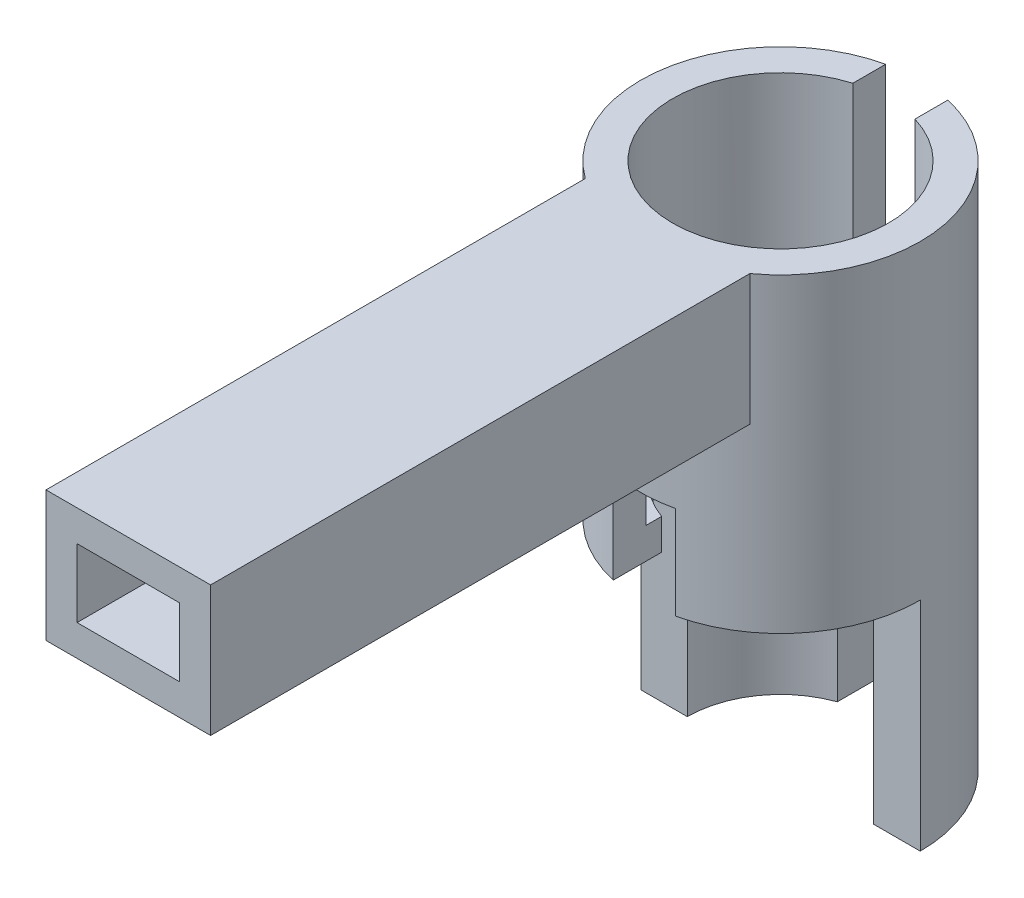
ISO-10303-21;
HEADER;
FILE_DESCRIPTION(('STEP AP214'),'2;1');
FILE_NAME('part.step','',(''),(''),'','','');
FILE_SCHEMA(('AUTOMOTIVE_DESIGN { 1 0 10303 214 1 1 1 1 }'));
ENDSEC;
DATA;
#1=APPLICATION_CONTEXT('core data for automotive mechanical design processes');
#2=APPLICATION_PROTOCOL_DEFINITION('international standard','automotive_design',2000,#1);
#3=PRODUCT_CONTEXT('',#1,'mechanical');
#4=PRODUCT('Part','Part','',(#3));
#5=PRODUCT_RELATED_PRODUCT_CATEGORY('part','',(#4));
#6=PRODUCT_DEFINITION_FORMATION('','',#4);
#7=PRODUCT_DEFINITION_CONTEXT('part definition',#1,'design');
#8=PRODUCT_DEFINITION('design','',#6,#7);
#9=PRODUCT_DEFINITION_SHAPE('','',#8);
#10=(LENGTH_UNIT() NAMED_UNIT(*) SI_UNIT(.MILLI.,.METRE.));
#11=(NAMED_UNIT(*) PLANE_ANGLE_UNIT() SI_UNIT($,.RADIAN.));
#12=(NAMED_UNIT(*) SI_UNIT($,.STERADIAN.) SOLID_ANGLE_UNIT());
#13=UNCERTAINTY_MEASURE_WITH_UNIT(LENGTH_MEASURE(1.E-05),#10,'distance_accuracy_value','');
#14=(GEOMETRIC_REPRESENTATION_CONTEXT(3) GLOBAL_UNCERTAINTY_ASSIGNED_CONTEXT((#13)) GLOBAL_UNIT_ASSIGNED_CONTEXT((#10,
#11,#12)) REPRESENTATION_CONTEXT('',''));
#15=CARTESIAN_POINT('',(0.,0.,0.));
#16=DIRECTION('',(0.,0.,1.));
#17=DIRECTION('',(1.,0.,0.));
#18=AXIS2_PLACEMENT_3D('',#15,#16,#17);
#19=CARTESIAN_POINT('',(0.,17.,0.));
#20=DIRECTION('',(0.,-1.,0.));
#21=DIRECTION('',(0.,0.,-1.));
#22=AXIS2_PLACEMENT_3D('',#19,#20,#21);
#23=CYLINDRICAL_SURFACE('',#22,4.5);
#24=DIRECTION('',(0.,-1.,0.));
#25=VECTOR('',#24,1.);
#26=CARTESIAN_POINT('',(-1.,17.,-4.38748219369606));
#27=LINE('',#26,#25);
#28=CARTESIAN_POINT('',(-1.,0.,-4.38748219369606));
#29=VERTEX_POINT('',#28);
#30=CARTESIAN_POINT('',(-1.,17.,-4.38748219369606));
#31=VERTEX_POINT('',#30);
#32=EDGE_CURVE('E312',#29,#31,#27,.F.);
#33=ORIENTED_EDGE('',*,*,#32,.F.);
#34=CARTESIAN_POINT('',(0.,0.,0.));
#35=DIRECTION('',(0.,1.,0.));
#36=DIRECTION('',(0.,0.,1.));
#37=AXIS2_PLACEMENT_3D('',#34,#35,#36);
#38=CIRCLE('',#37,4.5);
#39=CARTESIAN_POINT('',(-4.5,0.,0.));
#40=VERTEX_POINT('',#39);
#41=EDGE_CURVE('E264',#29,#40,#38,.T.);
#42=ORIENTED_EDGE('',*,*,#41,.T.);
#43=DIRECTION('',(0.,-1.,0.));
#44=VECTOR('',#43,1.);
#45=CARTESIAN_POINT('',(-4.5,17.,0.));
#46=LINE('',#45,#44);
#47=CARTESIAN_POINT('',(-4.5,7.,0.));
#48=VERTEX_POINT('',#47);
#49=EDGE_CURVE('E333',#48,#40,#46,.T.);
#50=ORIENTED_EDGE('',*,*,#49,.F.);
#51=CARTESIAN_POINT('',(0.,7.,0.));
#52=DIRECTION('',(0.,-1.,0.));
#53=DIRECTION('',(0.,0.,-1.));
#54=AXIS2_PLACEMENT_3D('',#51,#52,#53);
#55=CIRCLE('',#54,4.5);
#56=CARTESIAN_POINT('',(-1.,7.,4.38748219369606));
#57=VERTEX_POINT('',#56);
#58=EDGE_CURVE('E324',#57,#48,#55,.T.);
#59=ORIENTED_EDGE('',*,*,#58,.F.);
#60=DIRECTION('',(0.,-1.,0.));
#61=VECTOR('',#60,1.);
#62=CARTESIAN_POINT('',(-1.,17.,4.38748219369606));
#63=LINE('',#62,#61);
#64=CARTESIAN_POINT('',(-1.,10.,4.38748219369606));
#65=VERTEX_POINT('',#64);
#66=EDGE_CURVE('E347',#65,#57,#63,.T.);
#67=ORIENTED_EDGE('',*,*,#66,.F.);
#68=CARTESIAN_POINT('',(0.,10.,0.));
#69=DIRECTION('',(0.,1.,0.));
#70=DIRECTION('',(0.,0.,1.));
#71=AXIS2_PLACEMENT_3D('',#68,#69,#70);
#72=CIRCLE('',#71,4.5);
#73=CARTESIAN_POINT('',(1.,10.,4.38748219369606));
#74=VERTEX_POINT('',#73);
#75=EDGE_CURVE('E357',#65,#74,#72,.T.);
#76=ORIENTED_EDGE('',*,*,#75,.T.);
#77=DIRECTION('',(0.,-1.,0.));
#78=VECTOR('',#77,1.);
#79=CARTESIAN_POINT('',(1.,17.,4.38748219369606));
#80=LINE('',#79,#78);
#81=CARTESIAN_POINT('',(1.,7.,4.38748219369606));
#82=VERTEX_POINT('',#81);
#83=EDGE_CURVE('E355',#82,#74,#80,.F.);
#84=ORIENTED_EDGE('',*,*,#83,.F.);
#85=CARTESIAN_POINT('',(4.5,7.,0.));
#86=VERTEX_POINT('',#85);
#87=EDGE_CURVE('E328',#86,#82,#55,.T.);
#88=ORIENTED_EDGE('',*,*,#87,.F.);
#89=DIRECTION('',(0.,-1.,0.));
#90=VECTOR('',#89,1.);
#91=CARTESIAN_POINT('',(4.5,17.,0.));
#92=LINE('',#91,#90);
#93=CARTESIAN_POINT('',(4.5,0.,0.));
#94=VERTEX_POINT('',#93);
#95=EDGE_CURVE('E331',#94,#86,#92,.F.);
#96=ORIENTED_EDGE('',*,*,#95,.F.);
#97=CARTESIAN_POINT('',(1.,0.,-4.38748219369606));
#98=VERTEX_POINT('',#97);
#99=EDGE_CURVE('E273',#94,#98,#38,.T.);
#100=ORIENTED_EDGE('',*,*,#99,.T.);
#101=DIRECTION('',(0.,-1.,0.));
#102=VECTOR('',#101,1.);
#103=CARTESIAN_POINT('',(1.,17.,-4.38748219369606));
#104=LINE('',#103,#102);
#105=CARTESIAN_POINT('',(1.,17.,-4.38748219369606));
#106=VERTEX_POINT('',#105);
#107=EDGE_CURVE('E307',#106,#98,#104,.T.);
#108=ORIENTED_EDGE('',*,*,#107,.F.);
#109=CARTESIAN_POINT('',(0.,17.,0.));
#110=DIRECTION('',(0.,1.,0.));
#111=DIRECTION('',(0.,0.,1.));
#112=AXIS2_PLACEMENT_3D('',#109,#110,#111);
#113=CIRCLE('',#112,4.5);
#114=CARTESIAN_POINT('',(2.65,17.,3.63696301878367));
#115=VERTEX_POINT('',#114);
#116=EDGE_CURVE('E268',#115,#106,#113,.T.);
#117=ORIENTED_EDGE('',*,*,#116,.F.);
#118=DIRECTION('',(0.,-1.,0.));
#119=VECTOR('',#118,1.);
#120=CARTESIAN_POINT('',(2.65,17.,3.63696301878367));
#121=LINE('',#120,#119);
#122=CARTESIAN_POINT('',(2.65,12.8,3.63696301878367));
#123=VERTEX_POINT('',#122);
#124=EDGE_CURVE('E249',#123,#115,#121,.F.);
#125=ORIENTED_EDGE('',*,*,#124,.F.);
#126=CARTESIAN_POINT('',(0.,12.8,0.));
#127=DIRECTION('',(0.,1.,0.));
#128=DIRECTION('',(0.,0.,1.));
#129=AXIS2_PLACEMENT_3D('',#126,#127,#128);
#130=CIRCLE('',#129,4.5);
#131=CARTESIAN_POINT('',(-2.65,12.8,3.63696301878367));
#132=VERTEX_POINT('',#131);
#133=EDGE_CURVE('E243',#132,#123,#130,.T.);
#134=ORIENTED_EDGE('',*,*,#133,.F.);
#135=DIRECTION('',(0.,-1.,0.));
#136=VECTOR('',#135,1.);
#137=CARTESIAN_POINT('',(-2.65,17.,3.63696301878367));
#138=LINE('',#137,#136);
#139=CARTESIAN_POINT('',(-2.65,17.,3.63696301878367));
#140=VERTEX_POINT('',#139);
#141=EDGE_CURVE('E246',#140,#132,#138,.T.);
#142=ORIENTED_EDGE('',*,*,#141,.F.);
#143=EDGE_CURVE('E272',#31,#140,#113,.T.);
#144=ORIENTED_EDGE('',*,*,#143,.F.);
#145=EDGE_LOOP('',(#33,#42,#50,#59,#67,#76,#84,#88,#96,#100,#108,#117,#125,#134,#142,#144));
#146=FACE_BOUND('',#145,.T.);
#147=ADVANCED_FACE('F35',(#146),#23,.T.);
#148=CARTESIAN_POINT('',(0.,0.,0.));
#149=DIRECTION('',(0.,1.,0.));
#150=DIRECTION('',(0.,0.,1.));
#151=AXIS2_PLACEMENT_3D('',#148,#149,#150);
#152=PLANE('',#151);
#153=DIRECTION('',(0.,0.,-1.));
#154=VECTOR('',#153,1.);
#155=CARTESIAN_POINT('',(-1.,0.,0.));
#156=LINE('',#155,#154);
#157=CARTESIAN_POINT('',(-1.,0.,-2.82842712474619));
#158=VERTEX_POINT('',#157);
#159=EDGE_CURVE('E305',#158,#29,#156,.T.);
#160=ORIENTED_EDGE('',*,*,#159,.F.);
#161=CARTESIAN_POINT('',(0.,0.,0.));
#162=DIRECTION('',(0.,1.,0.));
#163=DIRECTION('',(0.,0.,1.));
#164=AXIS2_PLACEMENT_3D('',#161,#162,#163);
#165=CIRCLE('',#164,3.);
#166=CARTESIAN_POINT('',(-3.,0.,0.));
#167=VERTEX_POINT('',#166);
#168=EDGE_CURVE('E257',#158,#167,#165,.T.);
#169=ORIENTED_EDGE('',*,*,#168,.T.);
#170=DIRECTION('',(-1.,0.,0.));
#171=VECTOR('',#170,1.);
#172=CARTESIAN_POINT('',(7.42344171639214,0.,0.));
#173=LINE('',#172,#171);
#174=EDGE_CURVE('E314',#167,#40,#173,.T.);
#175=ORIENTED_EDGE('',*,*,#174,.T.);
#176=ORIENTED_EDGE('',*,*,#41,.F.);
#177=EDGE_LOOP('',(#160,#169,#175,#176));
#178=FACE_BOUND('',#177,.T.);
#179=ADVANCED_FACE('F447',(#178),#152,.F.);
#180=DIRECTION('',(0.,0.,1.));
#181=VECTOR('',#180,1.);
#182=CARTESIAN_POINT('',(1.,0.,0.));
#183=LINE('',#182,#181);
#184=CARTESIAN_POINT('',(1.,0.,-2.82842712474619));
#185=VERTEX_POINT('',#184);
#186=EDGE_CURVE('E399',#98,#185,#183,.T.);
#187=ORIENTED_EDGE('',*,*,#186,.F.);
#188=ORIENTED_EDGE('',*,*,#99,.F.);
#189=CARTESIAN_POINT('',(3.,0.,0.));
#190=VERTEX_POINT('',#189);
#191=EDGE_CURVE('E319',#94,#190,#173,.T.);
#192=ORIENTED_EDGE('',*,*,#191,.T.);
#193=EDGE_CURVE('E253',#190,#185,#165,.T.);
#194=ORIENTED_EDGE('',*,*,#193,.T.);
#195=EDGE_LOOP('',(#187,#188,#192,#194));
#196=FACE_BOUND('',#195,.T.);
#197=ADVANCED_FACE('F473',(#196),#152,.F.);
#198=CARTESIAN_POINT('',(0.,0.,0.));
#199=DIRECTION('',(0.,1.,0.));
#200=DIRECTION('',(0.,0.,1.));
#201=AXIS2_PLACEMENT_3D('',#198,#199,#200);
#202=CYLINDRICAL_SURFACE('',#201,3.);
#203=DIRECTION('',(0.,1.,0.));
#204=VECTOR('',#203,1.);
#205=CARTESIAN_POINT('',(-1.,0.,-2.82842712474619));
#206=LINE('',#205,#204);
#207=CARTESIAN_POINT('',(-1.,8.,-2.82842712474619));
#208=VERTEX_POINT('',#207);
#209=EDGE_CURVE('E302',#208,#158,#206,.F.);
#210=ORIENTED_EDGE('',*,*,#209,.F.);
#211=CARTESIAN_POINT('',(0.,8.,0.));
#212=DIRECTION('',(0.,1.,0.));
#213=DIRECTION('',(0.,0.,1.));
#214=AXIS2_PLACEMENT_3D('',#211,#212,#213);
#215=CIRCLE('',#214,3.);
#216=CARTESIAN_POINT('',(-1.,8.,2.82842712474619));
#217=VERTEX_POINT('',#216);
#218=EDGE_CURVE('E252',#208,#217,#215,.T.);
#219=ORIENTED_EDGE('',*,*,#218,.T.);
#220=DIRECTION('',(0.,1.,0.));
#221=VECTOR('',#220,1.);
#222=CARTESIAN_POINT('',(-1.,0.,2.82842712474619));
#223=LINE('',#222,#221);
#224=CARTESIAN_POINT('',(-1.,7.,2.82842712474619));
#225=VERTEX_POINT('',#224);
#226=EDGE_CURVE('E271',#225,#217,#223,.T.);
#227=ORIENTED_EDGE('',*,*,#226,.F.);
#228=CARTESIAN_POINT('',(0.,7.,0.));
#229=DIRECTION('',(0.,-1.,0.));
#230=DIRECTION('',(0.,0.,-1.));
#231=AXIS2_PLACEMENT_3D('',#228,#229,#230);
#232=CIRCLE('',#231,3.);
#233=CARTESIAN_POINT('',(-3.,7.,0.));
#234=VERTEX_POINT('',#233);
#235=EDGE_CURVE('E322',#234,#225,#232,.F.);
#236=ORIENTED_EDGE('',*,*,#235,.F.);
#237=DIRECTION('',(0.,1.,0.));
#238=VECTOR('',#237,1.);
#239=CARTESIAN_POINT('',(-3.,0.,0.));
#240=LINE('',#239,#238);
#241=EDGE_CURVE('E289',#167,#234,#240,.T.);
#242=ORIENTED_EDGE('',*,*,#241,.F.);
#243=ORIENTED_EDGE('',*,*,#168,.F.);
#244=EDGE_LOOP('',(#210,#219,#227,#236,#242,#243));
#245=FACE_BOUND('',#244,.T.);
#246=ADVANCED_FACE('F442',(#245),#202,.F.);
#247=DIRECTION('',(0.,1.,0.));
#248=VECTOR('',#247,1.);
#249=CARTESIAN_POINT('',(1.,0.,-2.82842712474619));
#250=LINE('',#249,#248);
#251=CARTESIAN_POINT('',(1.,8.,-2.82842712474619));
#252=VERTEX_POINT('',#251);
#253=EDGE_CURVE('E400',#185,#252,#250,.T.);
#254=ORIENTED_EDGE('',*,*,#253,.F.);
#255=ORIENTED_EDGE('',*,*,#193,.F.);
#256=DIRECTION('',(0.,1.,0.));
#257=VECTOR('',#256,1.);
#258=CARTESIAN_POINT('',(3.,0.,0.));
#259=LINE('',#258,#257);
#260=CARTESIAN_POINT('',(3.,7.,0.));
#261=VERTEX_POINT('',#260);
#262=EDGE_CURVE('E287',#261,#190,#259,.F.);
#263=ORIENTED_EDGE('',*,*,#262,.F.);
#264=CARTESIAN_POINT('',(1.,7.,2.82842712474619));
#265=VERTEX_POINT('',#264);
#266=EDGE_CURVE('E325',#265,#261,#232,.F.);
#267=ORIENTED_EDGE('',*,*,#266,.F.);
#268=DIRECTION('',(0.,1.,0.));
#269=VECTOR('',#268,1.);
#270=CARTESIAN_POINT('',(1.,0.,2.82842712474619));
#271=LINE('',#270,#269);
#272=CARTESIAN_POINT('',(1.,8.,2.82842712474619));
#273=VERTEX_POINT('',#272);
#274=EDGE_CURVE('E278',#273,#265,#271,.F.);
#275=ORIENTED_EDGE('',*,*,#274,.F.);
#276=EDGE_CURVE('E258',#273,#252,#215,.T.);
#277=ORIENTED_EDGE('',*,*,#276,.T.);
#278=EDGE_LOOP('',(#254,#255,#263,#267,#275,#277));
#279=FACE_BOUND('',#278,.T.);
#280=ADVANCED_FACE('F415',(#279),#202,.F.);
#281=CARTESIAN_POINT('',(0.,8.,0.));
#282=DIRECTION('',(0.,1.,0.));
#283=DIRECTION('',(0.,0.,1.));
#284=AXIS2_PLACEMENT_3D('',#281,#282,#283);
#285=CYLINDRICAL_SURFACE('',#284,3.475);
#286=DIRECTION('',(0.,1.,0.));
#287=VECTOR('',#286,1.);
#288=CARTESIAN_POINT('',(-1.,8.,-3.32800615985007));
#289=LINE('',#288,#287);
#290=CARTESIAN_POINT('',(-1.,17.,-3.32800615985007));
#291=VERTEX_POINT('',#290);
#292=CARTESIAN_POINT('',(-1.,8.,-3.32800615985007));
#293=VERTEX_POINT('',#292);
#294=EDGE_CURVE('E298',#291,#293,#289,.F.);
#295=ORIENTED_EDGE('',*,*,#294,.F.);
#296=CARTESIAN_POINT('',(0.,17.,0.));
#297=DIRECTION('',(0.,1.,0.));
#298=DIRECTION('',(0.,0.,1.));
#299=AXIS2_PLACEMENT_3D('',#296,#297,#298);
#300=CIRCLE('',#299,3.475);
#301=CARTESIAN_POINT('',(1.,17.,-3.32800615985007));
#302=VERTEX_POINT('',#301);
#303=EDGE_CURVE('E256',#291,#302,#300,.T.);
#304=ORIENTED_EDGE('',*,*,#303,.T.);
#305=DIRECTION('',(0.,1.,0.));
#306=VECTOR('',#305,1.);
#307=CARTESIAN_POINT('',(1.,8.,-3.32800615985007));
#308=LINE('',#307,#306);
#309=CARTESIAN_POINT('',(1.,8.,-3.32800615985007));
#310=VERTEX_POINT('',#309);
#311=EDGE_CURVE('E57',#310,#302,#308,.T.);
#312=ORIENTED_EDGE('',*,*,#311,.F.);
#313=CARTESIAN_POINT('',(0.,8.,0.));
#314=DIRECTION('',(0.,1.,0.));
#315=DIRECTION('',(0.,0.,1.));
#316=AXIS2_PLACEMENT_3D('',#313,#314,#315);
#317=CIRCLE('',#316,3.475);
#318=CARTESIAN_POINT('',(1.,8.,3.32800615985007));
#319=VERTEX_POINT('',#318);
#320=EDGE_CURVE('E261',#319,#310,#317,.T.);
#321=ORIENTED_EDGE('',*,*,#320,.F.);
#322=DIRECTION('',(0.,1.,0.));
#323=VECTOR('',#322,1.);
#324=CARTESIAN_POINT('',(1.,8.,3.32800615985007));
#325=LINE('',#324,#323);
#326=CARTESIAN_POINT('',(1.,10.,3.32800615985007));
#327=VERTEX_POINT('',#326);
#328=EDGE_CURVE('E353',#327,#319,#325,.F.);
#329=ORIENTED_EDGE('',*,*,#328,.F.);
#330=CARTESIAN_POINT('',(0.,10.,0.));
#331=DIRECTION('',(0.,1.,0.));
#332=DIRECTION('',(0.,0.,1.));
#333=AXIS2_PLACEMENT_3D('',#330,#331,#332);
#334=CIRCLE('',#333,3.475);
#335=CARTESIAN_POINT('',(-1.,10.,3.32800615985007));
#336=VERTEX_POINT('',#335);
#337=EDGE_CURVE('E281',#327,#336,#334,.F.);
#338=ORIENTED_EDGE('',*,*,#337,.T.);
#339=DIRECTION('',(0.,1.,0.));
#340=VECTOR('',#339,1.);
#341=CARTESIAN_POINT('',(-1.,8.,3.32800615985007));
#342=LINE('',#341,#340);
#343=CARTESIAN_POINT('',(-1.,8.,3.32800615985007));
#344=VERTEX_POINT('',#343);
#345=EDGE_CURVE('E345',#344,#336,#342,.T.);
#346=ORIENTED_EDGE('',*,*,#345,.F.);
#347=EDGE_CURVE('E265',#293,#344,#317,.T.);
#348=ORIENTED_EDGE('',*,*,#347,.F.);
#349=EDGE_LOOP('',(#295,#304,#312,#321,#329,#338,#346,#348));
#350=FACE_BOUND('',#349,.T.);
#351=CARTESIAN_POINT('',(0.,16.,0.));
#352=DIRECTION('',(0.,1.,0.));
#353=DIRECTION('',(0.,0.,1.));
#354=AXIS2_PLACEMENT_3D('',#351,#352,#353);
#355=CIRCLE('',#354,3.475);
#356=CARTESIAN_POINT('',(-1.65,16.,3.05828791973549));
#357=VERTEX_POINT('',#356);
#358=CARTESIAN_POINT('',(1.65,16.,3.05828791973549));
#359=VERTEX_POINT('',#358);
#360=EDGE_CURVE('E192',#357,#359,#355,.T.);
#361=ORIENTED_EDGE('',*,*,#360,.F.);
#362=DIRECTION('',(0.,1.,0.));
#363=VECTOR('',#362,1.);
#364=CARTESIAN_POINT('',(-1.65,10.,3.05828791973549));
#365=LINE('',#364,#363);
#366=CARTESIAN_POINT('',(-1.65,13.8,3.05828791973549));
#367=VERTEX_POINT('',#366);
#368=EDGE_CURVE('E195',#367,#357,#365,.T.);
#369=ORIENTED_EDGE('',*,*,#368,.F.);
#370=CARTESIAN_POINT('',(0.,13.8,0.));
#371=DIRECTION('',(0.,-1.,0.));
#372=DIRECTION('',(0.,0.,-1.));
#373=AXIS2_PLACEMENT_3D('',#370,#371,#372);
#374=CIRCLE('',#373,3.475);
#375=CARTESIAN_POINT('',(1.65,13.8,3.05828791973549));
#376=VERTEX_POINT('',#375);
#377=EDGE_CURVE('E208',#376,#367,#374,.T.);
#378=ORIENTED_EDGE('',*,*,#377,.F.);
#379=DIRECTION('',(0.,1.,0.));
#380=VECTOR('',#379,1.);
#381=CARTESIAN_POINT('',(1.65,10.,3.05828791973549));
#382=LINE('',#381,#380);
#383=EDGE_CURVE('E49',#359,#376,#382,.F.);
#384=ORIENTED_EDGE('',*,*,#383,.F.);
#385=EDGE_LOOP('',(#361,#369,#378,#384));
#386=FACE_BOUND('',#385,.T.);
#387=ADVANCED_FACE('F194',(#350,#386),#285,.F.);
#388=CARTESIAN_POINT('',(0.,8.,0.));
#389=DIRECTION('',(0.,1.,0.));
#390=DIRECTION('',(0.,0.,1.));
#391=AXIS2_PLACEMENT_3D('',#388,#389,#390);
#392=PLANE('',#391);
#393=ORIENTED_EDGE('',*,*,#218,.F.);
#394=DIRECTION('',(0.,0.,-1.));
#395=VECTOR('',#394,1.);
#396=CARTESIAN_POINT('',(-1.,8.,0.));
#397=LINE('',#396,#395);
#398=EDGE_CURVE('E303',#208,#293,#397,.T.);
#399=ORIENTED_EDGE('',*,*,#398,.T.);
#400=ORIENTED_EDGE('',*,*,#347,.T.);
#401=DIRECTION('',(0.,0.,-1.));
#402=VECTOR('',#401,1.);
#403=CARTESIAN_POINT('',(-1.,8.,0.));
#404=LINE('',#403,#402);
#405=EDGE_CURVE('E342',#344,#217,#404,.T.);
#406=ORIENTED_EDGE('',*,*,#405,.T.);
#407=EDGE_LOOP('',(#393,#399,#400,#406));
#408=FACE_BOUND('',#407,.T.);
#409=ADVANCED_FACE('F436',(#408),#392,.T.);
#410=ORIENTED_EDGE('',*,*,#320,.T.);
#411=DIRECTION('',(0.,0.,1.));
#412=VECTOR('',#411,1.);
#413=CARTESIAN_POINT('',(1.,8.,0.));
#414=LINE('',#413,#412);
#415=EDGE_CURVE('E405',#310,#252,#414,.T.);
#416=ORIENTED_EDGE('',*,*,#415,.T.);
#417=ORIENTED_EDGE('',*,*,#276,.F.);
#418=DIRECTION('',(0.,0.,1.));
#419=VECTOR('',#418,1.);
#420=CARTESIAN_POINT('',(0.999999999999999,8.,0.));
#421=LINE('',#420,#419);
#422=EDGE_CURVE('E350',#273,#319,#421,.T.);
#423=ORIENTED_EDGE('',*,*,#422,.T.);
#424=EDGE_LOOP('',(#410,#416,#417,#423));
#425=FACE_BOUND('',#424,.T.);
#426=ADVANCED_FACE('F411',(#425),#392,.T.);
#427=CARTESIAN_POINT('',(0.,17.,0.));
#428=DIRECTION('',(0.,1.,0.));
#429=DIRECTION('',(0.,0.,1.));
#430=AXIS2_PLACEMENT_3D('',#427,#428,#429);
#431=PLANE('',#430);
#432=ORIENTED_EDGE('',*,*,#303,.F.);
#433=DIRECTION('',(0.,0.,-1.));
#434=VECTOR('',#433,1.);
#435=CARTESIAN_POINT('',(-1.,17.,0.));
#436=LINE('',#435,#434);
#437=EDGE_CURVE('E11',#291,#31,#436,.T.);
#438=ORIENTED_EDGE('',*,*,#437,.T.);
#439=ORIENTED_EDGE('',*,*,#143,.T.);
#440=DIRECTION('',(0.,0.,-1.));
#441=VECTOR('',#440,1.);
#442=CARTESIAN_POINT('',(-2.65,17.,21.));
#443=LINE('',#442,#441);
#444=CARTESIAN_POINT('',(-2.65,17.,21.));
#445=VERTEX_POINT('',#444);
#446=EDGE_CURVE('E237',#445,#140,#443,.T.);
#447=ORIENTED_EDGE('',*,*,#446,.F.);
#448=DIRECTION('',(-1.,0.,0.));
#449=VECTOR('',#448,1.);
#450=CARTESIAN_POINT('',(-2.65,17.,21.));
#451=LINE('',#450,#449);
#452=CARTESIAN_POINT('',(2.65,17.,21.));
#453=VERTEX_POINT('',#452);
#454=EDGE_CURVE('E225',#453,#445,#451,.T.);
#455=ORIENTED_EDGE('',*,*,#454,.F.);
#456=DIRECTION('',(0.,0.,-1.));
#457=VECTOR('',#456,1.);
#458=CARTESIAN_POINT('',(2.65,17.,21.));
#459=LINE('',#458,#457);
#460=EDGE_CURVE('E240',#453,#115,#459,.T.);
#461=ORIENTED_EDGE('',*,*,#460,.T.);
#462=ORIENTED_EDGE('',*,*,#116,.T.);
#463=DIRECTION('',(0.,0.,1.));
#464=VECTOR('',#463,1.);
#465=CARTESIAN_POINT('',(1.,17.,0.));
#466=LINE('',#465,#464);
#467=EDGE_CURVE('E42',#106,#302,#466,.T.);
#468=ORIENTED_EDGE('',*,*,#467,.T.);
#469=EDGE_LOOP('',(#432,#438,#439,#447,#455,#461,#462,#468));
#470=FACE_BOUND('',#469,.T.);
#471=ADVANCED_FACE('F291',(#470),#431,.T.);
#472=CARTESIAN_POINT('',(1.,10.,2.39019885919907));
#473=DIRECTION('',(-1.,0.,0.));
#474=DIRECTION('',(0.,0.,1.));
#475=AXIS2_PLACEMENT_3D('',#472,#473,#474);
#476=PLANE('',#475);
#477=ORIENTED_EDGE('',*,*,#274,.T.);
#478=DIRECTION('',(0.,0.,1.));
#479=VECTOR('',#478,1.);
#480=CARTESIAN_POINT('',(1.,7.,2.39019885919907));
#481=LINE('',#480,#479);
#482=EDGE_CURVE('E327',#265,#82,#481,.T.);
#483=ORIENTED_EDGE('',*,*,#482,.T.);
#484=ORIENTED_EDGE('',*,*,#83,.T.);
#485=DIRECTION('',(0.,0.,-1.));
#486=VECTOR('',#485,1.);
#487=CARTESIAN_POINT('',(1.,10.,2.39019885919907));
#488=LINE('',#487,#486);
#489=EDGE_CURVE('E336',#74,#327,#488,.T.);
#490=ORIENTED_EDGE('',*,*,#489,.T.);
#491=ORIENTED_EDGE('',*,*,#328,.T.);
#492=ORIENTED_EDGE('',*,*,#422,.F.);
#493=EDGE_LOOP('',(#477,#483,#484,#490,#491,#492));
#494=FACE_BOUND('',#493,.T.);
#495=ADVANCED_FACE('F420',(#494),#476,.T.);
#496=CARTESIAN_POINT('',(-1.,10.,2.39019885919907));
#497=DIRECTION('',(1.,0.,0.));
#498=DIRECTION('',(0.,0.,-1.));
#499=AXIS2_PLACEMENT_3D('',#496,#497,#498);
#500=PLANE('',#499);
#501=ORIENTED_EDGE('',*,*,#66,.T.);
#502=DIRECTION('',(0.,0.,-1.));
#503=VECTOR('',#502,1.);
#504=CARTESIAN_POINT('',(-1.,7.,2.39019885919907));
#505=LINE('',#504,#503);
#506=EDGE_CURVE('E284',#57,#225,#505,.T.);
#507=ORIENTED_EDGE('',*,*,#506,.T.);
#508=ORIENTED_EDGE('',*,*,#226,.T.);
#509=ORIENTED_EDGE('',*,*,#405,.F.);
#510=ORIENTED_EDGE('',*,*,#345,.T.);
#511=DIRECTION('',(0.,0.,1.));
#512=VECTOR('',#511,1.);
#513=CARTESIAN_POINT('',(-1.,10.,2.39019885919907));
#514=LINE('',#513,#512);
#515=EDGE_CURVE('E339',#336,#65,#514,.T.);
#516=ORIENTED_EDGE('',*,*,#515,.T.);
#517=EDGE_LOOP('',(#501,#507,#508,#509,#510,#516));
#518=FACE_BOUND('',#517,.T.);
#519=ADVANCED_FACE('F431',(#518),#500,.T.);
#520=CARTESIAN_POINT('',(2.65,12.8,21.));
#521=DIRECTION('',(-1.,0.,0.));
#522=DIRECTION('',(0.,0.,1.));
#523=AXIS2_PLACEMENT_3D('',#520,#521,#522);
#524=PLANE('',#523);
#525=DIRECTION('',(0.,0.,-1.));
#526=VECTOR('',#525,1.);
#527=CARTESIAN_POINT('',(2.65,12.8,21.));
#528=LINE('',#527,#526);
#529=CARTESIAN_POINT('',(2.65,12.8,21.));
#530=VERTEX_POINT('',#529);
#531=EDGE_CURVE('E231',#530,#123,#528,.T.);
#532=ORIENTED_EDGE('',*,*,#531,.T.);
#533=ORIENTED_EDGE('',*,*,#124,.T.);
#534=ORIENTED_EDGE('',*,*,#460,.F.);
#535=DIRECTION('',(0.,1.,0.));
#536=VECTOR('',#535,1.);
#537=CARTESIAN_POINT('',(2.65,12.8,21.));
#538=LINE('',#537,#536);
#539=EDGE_CURVE('E222',#530,#453,#538,.T.);
#540=ORIENTED_EDGE('',*,*,#539,.F.);
#541=EDGE_LOOP('',(#532,#533,#534,#540));
#542=FACE_BOUND('',#541,.T.);
#543=ADVANCED_FACE('F386',(#542),#524,.F.);
#544=CARTESIAN_POINT('',(-2.65,12.8,21.));
#545=DIRECTION('',(1.,0.,0.));
#546=DIRECTION('',(0.,0.,-1.));
#547=AXIS2_PLACEMENT_3D('',#544,#545,#546);
#548=PLANE('',#547);
#549=ORIENTED_EDGE('',*,*,#446,.T.);
#550=ORIENTED_EDGE('',*,*,#141,.T.);
#551=DIRECTION('',(0.,0.,-1.));
#552=VECTOR('',#551,1.);
#553=CARTESIAN_POINT('',(-2.65,12.8,21.));
#554=LINE('',#553,#552);
#555=CARTESIAN_POINT('',(-2.65,12.8,21.));
#556=VERTEX_POINT('',#555);
#557=EDGE_CURVE('E234',#556,#132,#554,.T.);
#558=ORIENTED_EDGE('',*,*,#557,.F.);
#559=DIRECTION('',(0.,-1.,0.));
#560=VECTOR('',#559,1.);
#561=CARTESIAN_POINT('',(-2.65,12.8,21.));
#562=LINE('',#561,#560);
#563=EDGE_CURVE('E227',#445,#556,#562,.T.);
#564=ORIENTED_EDGE('',*,*,#563,.F.);
#565=EDGE_LOOP('',(#549,#550,#558,#564));
#566=FACE_BOUND('',#565,.T.);
#567=ADVANCED_FACE('F392',(#566),#548,.F.);
#568=CARTESIAN_POINT('',(-2.65,12.8,21.));
#569=DIRECTION('',(0.,1.,0.));
#570=DIRECTION('',(0.,0.,1.));
#571=AXIS2_PLACEMENT_3D('',#568,#569,#570);
#572=PLANE('',#571);
#573=ORIENTED_EDGE('',*,*,#557,.T.);
#574=ORIENTED_EDGE('',*,*,#133,.T.);
#575=ORIENTED_EDGE('',*,*,#531,.F.);
#576=DIRECTION('',(1.,0.,0.));
#577=VECTOR('',#576,1.);
#578=CARTESIAN_POINT('',(-2.65,12.8,21.));
#579=LINE('',#578,#577);
#580=EDGE_CURVE('E229',#556,#530,#579,.T.);
#581=ORIENTED_EDGE('',*,*,#580,.F.);
#582=EDGE_LOOP('',(#573,#574,#575,#581));
#583=FACE_BOUND('',#582,.T.);
#584=ADVANCED_FACE('F378',(#583),#572,.F.);
#585=CARTESIAN_POINT('',(0.,0.,21.));
#586=DIRECTION('',(0.,0.,-1.));
#587=DIRECTION('',(-1.,0.,0.));
#588=AXIS2_PLACEMENT_3D('',#585,#586,#587);
#589=PLANE('',#588);
#590=DIRECTION('',(-1.,0.,0.));
#591=VECTOR('',#590,1.);
#592=CARTESIAN_POINT('',(-1.65,16.,21.));
#593=LINE('',#592,#591);
#594=CARTESIAN_POINT('',(1.65,16.,21.));
#595=VERTEX_POINT('',#594);
#596=CARTESIAN_POINT('',(-1.65,16.,21.));
#597=VERTEX_POINT('',#596);
#598=EDGE_CURVE('E212',#595,#597,#593,.T.);
#599=ORIENTED_EDGE('',*,*,#598,.F.);
#600=DIRECTION('',(0.,1.,0.));
#601=VECTOR('',#600,1.);
#602=CARTESIAN_POINT('',(1.65,13.8,21.));
#603=LINE('',#602,#601);
#604=CARTESIAN_POINT('',(1.65,13.8,21.));
#605=VERTEX_POINT('',#604);
#606=EDGE_CURVE('E360',#605,#595,#603,.T.);
#607=ORIENTED_EDGE('',*,*,#606,.F.);
#608=DIRECTION('',(1.,0.,0.));
#609=VECTOR('',#608,1.);
#610=CARTESIAN_POINT('',(-1.65,13.8,21.));
#611=LINE('',#610,#609);
#612=CARTESIAN_POINT('',(-1.65,13.8,21.));
#613=VERTEX_POINT('',#612);
#614=EDGE_CURVE('E218',#613,#605,#611,.T.);
#615=ORIENTED_EDGE('',*,*,#614,.F.);
#616=DIRECTION('',(0.,-1.,0.));
#617=VECTOR('',#616,1.);
#618=CARTESIAN_POINT('',(-1.65,13.8,21.));
#619=LINE('',#618,#617);
#620=EDGE_CURVE('E364',#597,#613,#619,.T.);
#621=ORIENTED_EDGE('',*,*,#620,.F.);
#622=EDGE_LOOP('',(#599,#607,#615,#621));
#623=FACE_BOUND('',#622,.T.);
#624=ORIENTED_EDGE('',*,*,#539,.T.);
#625=ORIENTED_EDGE('',*,*,#454,.T.);
#626=ORIENTED_EDGE('',*,*,#563,.T.);
#627=ORIENTED_EDGE('',*,*,#580,.T.);
#628=EDGE_LOOP('',(#624,#625,#626,#627));
#629=FACE_BOUND('',#628,.T.);
#630=ADVANCED_FACE('F375',(#623,#629),#589,.F.);
#631=CARTESIAN_POINT('',(1.65,13.8,0.999999999999997));
#632=DIRECTION('',(1.,0.,0.));
#633=DIRECTION('',(0.,0.,-1.));
#634=AXIS2_PLACEMENT_3D('',#631,#632,#633);
#635=PLANE('',#634);
#636=DIRECTION('',(0.,0.,1.));
#637=VECTOR('',#636,1.);
#638=CARTESIAN_POINT('',(1.65,16.,0.999999999999997));
#639=LINE('',#638,#637);
#640=EDGE_CURVE('E214',#359,#595,#639,.T.);
#641=ORIENTED_EDGE('',*,*,#640,.F.);
#642=ORIENTED_EDGE('',*,*,#383,.T.);
#643=DIRECTION('',(0.,0.,1.));
#644=VECTOR('',#643,1.);
#645=CARTESIAN_POINT('',(1.65,13.8,0.999999999999997));
#646=LINE('',#645,#644);
#647=EDGE_CURVE('E216',#376,#605,#646,.T.);
#648=ORIENTED_EDGE('',*,*,#647,.T.);
#649=ORIENTED_EDGE('',*,*,#606,.T.);
#650=EDGE_LOOP('',(#641,#642,#648,#649));
#651=FACE_BOUND('',#650,.T.);
#652=ADVANCED_FACE('F369',(#651),#635,.F.);
#653=CARTESIAN_POINT('',(-1.65,13.8,0.999999999999997));
#654=DIRECTION('',(0.,-1.,0.));
#655=DIRECTION('',(0.,0.,-1.));
#656=AXIS2_PLACEMENT_3D('',#653,#654,#655);
#657=PLANE('',#656);
#658=ORIENTED_EDGE('',*,*,#647,.F.);
#659=ORIENTED_EDGE('',*,*,#377,.T.);
#660=DIRECTION('',(0.,0.,1.));
#661=VECTOR('',#660,1.);
#662=CARTESIAN_POINT('',(-1.65,13.8,0.999999999999997));
#663=LINE('',#662,#661);
#664=EDGE_CURVE('E207',#367,#613,#663,.T.);
#665=ORIENTED_EDGE('',*,*,#664,.T.);
#666=ORIENTED_EDGE('',*,*,#614,.T.);
#667=EDGE_LOOP('',(#658,#659,#665,#666));
#668=FACE_BOUND('',#667,.T.);
#669=ADVANCED_FACE('F373',(#668),#657,.F.);
#670=CARTESIAN_POINT('',(-1.65,13.8,0.999999999999997));
#671=DIRECTION('',(-1.,0.,0.));
#672=DIRECTION('',(0.,0.,1.));
#673=AXIS2_PLACEMENT_3D('',#670,#671,#672);
#674=PLANE('',#673);
#675=ORIENTED_EDGE('',*,*,#664,.F.);
#676=ORIENTED_EDGE('',*,*,#368,.T.);
#677=DIRECTION('',(0.,0.,1.));
#678=VECTOR('',#677,1.);
#679=CARTESIAN_POINT('',(-1.65,16.,0.999999999999997));
#680=LINE('',#679,#678);
#681=EDGE_CURVE('E205',#357,#597,#680,.T.);
#682=ORIENTED_EDGE('',*,*,#681,.T.);
#683=ORIENTED_EDGE('',*,*,#620,.T.);
#684=EDGE_LOOP('',(#675,#676,#682,#683));
#685=FACE_BOUND('',#684,.T.);
#686=ADVANCED_FACE('F203',(#685),#674,.F.);
#687=CARTESIAN_POINT('',(-1.65,16.,0.999999999999997));
#688=DIRECTION('',(0.,1.,0.));
#689=DIRECTION('',(0.,0.,1.));
#690=AXIS2_PLACEMENT_3D('',#687,#688,#689);
#691=PLANE('',#690);
#692=ORIENTED_EDGE('',*,*,#681,.F.);
#693=ORIENTED_EDGE('',*,*,#360,.T.);
#694=ORIENTED_EDGE('',*,*,#640,.T.);
#695=ORIENTED_EDGE('',*,*,#598,.T.);
#696=EDGE_LOOP('',(#692,#693,#694,#695));
#697=FACE_BOUND('',#696,.T.);
#698=ADVANCED_FACE('F210',(#697),#691,.F.);
#699=CARTESIAN_POINT('',(0.,10.,0.));
#700=DIRECTION('',(0.,1.,0.));
#701=DIRECTION('',(0.,0.,1.));
#702=AXIS2_PLACEMENT_3D('',#699,#700,#701);
#703=PLANE('',#702);
#704=ORIENTED_EDGE('',*,*,#515,.F.);
#705=ORIENTED_EDGE('',*,*,#337,.F.);
#706=ORIENTED_EDGE('',*,*,#489,.F.);
#707=ORIENTED_EDGE('',*,*,#75,.F.);
#708=EDGE_LOOP('',(#704,#705,#706,#707));
#709=FACE_BOUND('',#708,.T.);
#710=ADVANCED_FACE('F426',(#709),#703,.F.);
#711=CARTESIAN_POINT('',(0.,7.,0.));
#712=DIRECTION('',(0.,-1.,0.));
#713=DIRECTION('',(0.,0.,-1.));
#714=AXIS2_PLACEMENT_3D('',#711,#712,#713);
#715=PLANE('',#714);
#716=ORIENTED_EDGE('',*,*,#58,.T.);
#717=DIRECTION('',(-1.,0.,0.));
#718=VECTOR('',#717,1.);
#719=CARTESIAN_POINT('',(7.42344171639214,7.,0.));
#720=LINE('',#719,#718);
#721=EDGE_CURVE('E315',#234,#48,#720,.T.);
#722=ORIENTED_EDGE('',*,*,#721,.F.);
#723=ORIENTED_EDGE('',*,*,#235,.T.);
#724=ORIENTED_EDGE('',*,*,#506,.F.);
#725=EDGE_LOOP('',(#716,#722,#723,#724));
#726=FACE_BOUND('',#725,.T.);
#727=ADVANCED_FACE('F454',(#726),#715,.T.);
#728=CARTESIAN_POINT('',(7.42344171639214,7.,0.));
#729=DIRECTION('',(0.,0.,1.));
#730=DIRECTION('',(1.,0.,0.));
#731=AXIS2_PLACEMENT_3D('',#728,#729,#730);
#732=PLANE('',#731);
#733=ORIENTED_EDGE('',*,*,#49,.T.);
#734=ORIENTED_EDGE('',*,*,#174,.F.);
#735=ORIENTED_EDGE('',*,*,#241,.T.);
#736=ORIENTED_EDGE('',*,*,#721,.T.);
#737=EDGE_LOOP('',(#733,#734,#735,#736));
#738=FACE_BOUND('',#737,.T.);
#739=ADVANCED_FACE('F450',(#738),#732,.T.);
#740=ORIENTED_EDGE('',*,*,#95,.T.);
#741=EDGE_CURVE('E318',#86,#261,#720,.T.);
#742=ORIENTED_EDGE('',*,*,#741,.T.);
#743=ORIENTED_EDGE('',*,*,#262,.T.);
#744=ORIENTED_EDGE('',*,*,#191,.F.);
#745=EDGE_LOOP('',(#740,#742,#743,#744));
#746=FACE_BOUND('',#745,.T.);
#747=ADVANCED_FACE('F462',(#746),#732,.T.);
#748=ORIENTED_EDGE('',*,*,#87,.T.);
#749=ORIENTED_EDGE('',*,*,#482,.F.);
#750=ORIENTED_EDGE('',*,*,#266,.T.);
#751=ORIENTED_EDGE('',*,*,#741,.F.);
#752=EDGE_LOOP('',(#748,#749,#750,#751));
#753=FACE_BOUND('',#752,.T.);
#754=ADVANCED_FACE('F457',(#753),#715,.T.);
#755=CARTESIAN_POINT('',(1.,17.,-1.78648835857471));
#756=DIRECTION('',(-1.,0.,0.));
#757=DIRECTION('',(0.,0.,1.));
#758=AXIS2_PLACEMENT_3D('',#755,#756,#757);
#759=PLANE('',#758);
#760=ORIENTED_EDGE('',*,*,#107,.T.);
#761=ORIENTED_EDGE('',*,*,#186,.T.);
#762=ORIENTED_EDGE('',*,*,#253,.T.);
#763=ORIENTED_EDGE('',*,*,#415,.F.);
#764=ORIENTED_EDGE('',*,*,#311,.T.);
#765=ORIENTED_EDGE('',*,*,#467,.F.);
#766=EDGE_LOOP('',(#760,#761,#762,#763,#764,#765));
#767=FACE_BOUND('',#766,.T.);
#768=ADVANCED_FACE('F467',(#767),#759,.T.);
#769=CARTESIAN_POINT('',(-1.,17.,-1.78648835857471));
#770=DIRECTION('',(1.,0.,0.));
#771=DIRECTION('',(0.,0.,-1.));
#772=AXIS2_PLACEMENT_3D('',#769,#770,#771);
#773=PLANE('',#772);
#774=ORIENTED_EDGE('',*,*,#32,.T.);
#775=ORIENTED_EDGE('',*,*,#437,.F.);
#776=ORIENTED_EDGE('',*,*,#294,.T.);
#777=ORIENTED_EDGE('',*,*,#398,.F.);
#778=ORIENTED_EDGE('',*,*,#209,.T.);
#779=ORIENTED_EDGE('',*,*,#159,.T.);
#780=EDGE_LOOP('',(#774,#775,#776,#777,#778,#779));
#781=FACE_BOUND('',#780,.T.);
#782=ADVANCED_FACE('F438',(#781),#773,.T.);
#783=CLOSED_SHELL('',(#147,#179,#197,#246,#280,#387,#409,#426,#471,#495,#519,#543,#567,#584,
#630,#652,#669,#686,#698,#710,#727,#739,#747,#754,#768,#782));
#784=MANIFOLD_SOLID_BREP('B2',#783);
#785=ADVANCED_BREP_SHAPE_REPRESENTATION('',(#18,#784),#14);
#786=SHAPE_DEFINITION_REPRESENTATION(#9,#785);
ENDSEC;
END-ISO-10303-21;
